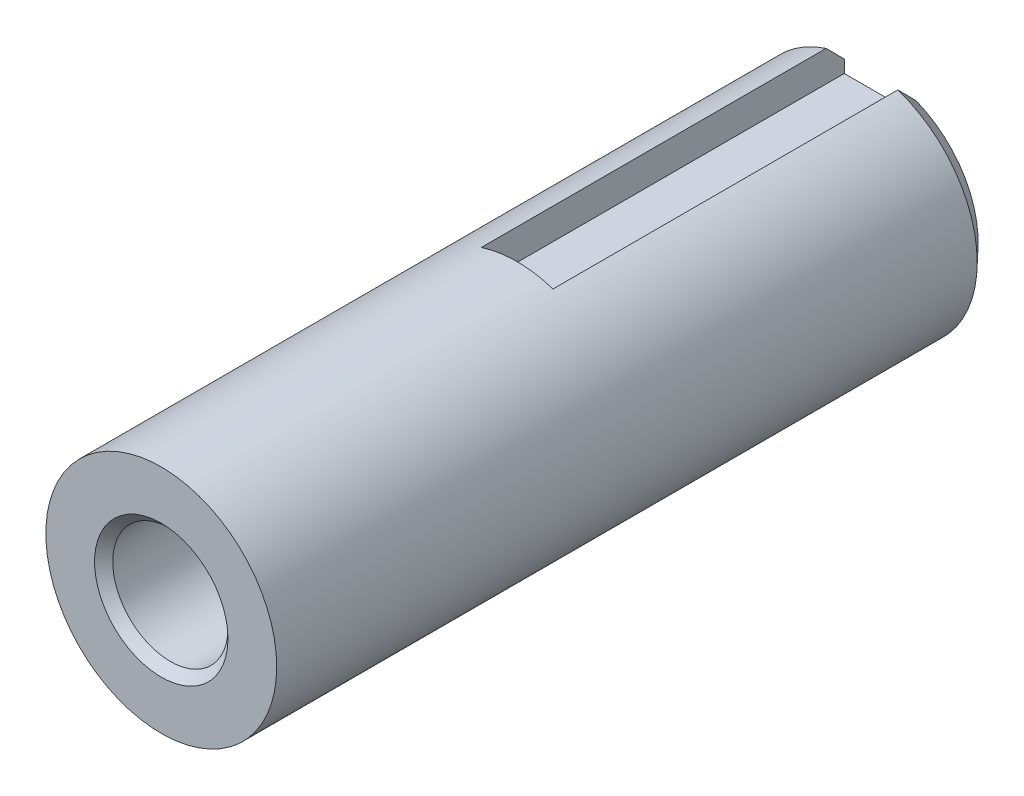
ISO-10303-21;
HEADER;
FILE_DESCRIPTION(('STEP AP214'),'2;1');
FILE_NAME('part.step','',(''),(''),'','','');
FILE_SCHEMA(('AUTOMOTIVE_DESIGN { 1 0 10303 214 1 1 1 1 }'));
ENDSEC;
DATA;
#1=APPLICATION_CONTEXT('core data for automotive mechanical design processes');
#2=APPLICATION_PROTOCOL_DEFINITION('international standard','automotive_design',2000,#1);
#3=PRODUCT_CONTEXT('',#1,'mechanical');
#4=PRODUCT('Part','Part','',(#3));
#5=PRODUCT_RELATED_PRODUCT_CATEGORY('part','',(#4));
#6=PRODUCT_DEFINITION_FORMATION('','',#4);
#7=PRODUCT_DEFINITION_CONTEXT('part definition',#1,'design');
#8=PRODUCT_DEFINITION('design','',#6,#7);
#9=PRODUCT_DEFINITION_SHAPE('','',#8);
#10=(LENGTH_UNIT() NAMED_UNIT(*) SI_UNIT(.MILLI.,.METRE.));
#11=(NAMED_UNIT(*) PLANE_ANGLE_UNIT() SI_UNIT($,.RADIAN.));
#12=(NAMED_UNIT(*) SI_UNIT($,.STERADIAN.) SOLID_ANGLE_UNIT());
#13=UNCERTAINTY_MEASURE_WITH_UNIT(LENGTH_MEASURE(1.E-05),#10,'distance_accuracy_value','');
#14=(GEOMETRIC_REPRESENTATION_CONTEXT(3) GLOBAL_UNCERTAINTY_ASSIGNED_CONTEXT((#13)) GLOBAL_UNIT_ASSIGNED_CONTEXT((#10,
#11,#12)) REPRESENTATION_CONTEXT('',''));
#15=CARTESIAN_POINT('',(0.,0.,0.));
#16=DIRECTION('',(0.,0.,1.));
#17=DIRECTION('',(1.,0.,0.));
#18=AXIS2_PLACEMENT_3D('',#15,#16,#17);
#19=CARTESIAN_POINT('',(0.,0.,-39.6));
#20=DIRECTION('',(0.,0.,1.));
#21=DIRECTION('',(1.,0.,0.));
#22=AXIS2_PLACEMENT_3D('',#19,#20,#21);
#23=CYLINDRICAL_SURFACE('',#22,6.36);
#24=DIRECTION('',(0.,0.,1.));
#25=VECTOR('',#24,1.);
#26=CARTESIAN_POINT('',(-1.96499999999999,6.048832531985,-39.6));
#27=LINE('',#26,#25);
#28=CARTESIAN_POINT('',(-1.96499999999999,6.048832531985,-38.6));
#29=VERTEX_POINT('',#28);
#30=CARTESIAN_POINT('',(-1.96499999999999,6.048832531985,-19.6));
#31=VERTEX_POINT('',#30);
#32=EDGE_CURVE('E113',#29,#31,#27,.T.);
#33=ORIENTED_EDGE('',*,*,#32,.F.);
#34=CARTESIAN_POINT('',(0.,0.,-38.6));
#35=DIRECTION('',(0.,0.,1.));
#36=DIRECTION('',(1.,0.,0.));
#37=AXIS2_PLACEMENT_3D('',#34,#35,#36);
#38=CIRCLE('',#37,6.36);
#39=CARTESIAN_POINT('',(1.985,6.04229881750315,-38.6));
#40=VERTEX_POINT('',#39);
#41=EDGE_CURVE('E123',#29,#40,#38,.T.);
#42=ORIENTED_EDGE('',*,*,#41,.T.);
#43=DIRECTION('',(0.,0.,1.));
#44=VECTOR('',#43,1.);
#45=CARTESIAN_POINT('',(1.985,6.04229881750315,-39.6));
#46=LINE('',#45,#44);
#47=CARTESIAN_POINT('',(1.985,6.04229881750315,-19.6));
#48=VERTEX_POINT('',#47);
#49=EDGE_CURVE('E110',#48,#40,#46,.F.);
#50=ORIENTED_EDGE('',*,*,#49,.F.);
#51=CARTESIAN_POINT('',(0.,0.,-19.6));
#52=DIRECTION('',(0.,0.,-1.));
#53=DIRECTION('',(-1.,0.,0.));
#54=AXIS2_PLACEMENT_3D('',#51,#52,#53);
#55=CIRCLE('',#54,6.36);
#56=EDGE_CURVE('E88',#48,#31,#55,.F.);
#57=ORIENTED_EDGE('',*,*,#56,.T.);
#58=EDGE_LOOP('',(#33,#42,#50,#57));
#59=FACE_BOUND('',#58,.T.);
#60=CARTESIAN_POINT('',(0.,0.,0.));
#61=DIRECTION('',(0.,0.,1.));
#62=DIRECTION('',(1.,0.,0.));
#63=AXIS2_PLACEMENT_3D('',#60,#61,#62);
#64=CIRCLE('',#63,6.36);
#65=CARTESIAN_POINT('',(6.36,0.,0.));
#66=VERTEX_POINT('',#65);
#67=EDGE_CURVE('E118',#66,#66,#64,.T.);
#68=ORIENTED_EDGE('',*,*,#67,.F.);
#69=EDGE_LOOP('',(#68));
#70=FACE_BOUND('',#69,.T.);
#71=ADVANCED_FACE('F33',(#59,#70),#23,.T.);
#72=CARTESIAN_POINT('',(0.,0.,-39.6));
#73=DIRECTION('',(0.,0.,1.));
#74=DIRECTION('',(1.,0.,0.));
#75=AXIS2_PLACEMENT_3D('',#72,#73,#74);
#76=PLANE('',#75);
#77=DIRECTION('',(0.,1.,0.));
#78=VECTOR('',#77,1.);
#79=CARTESIAN_POINT('',(1.985,0.,-39.6));
#80=LINE('',#79,#78);
#81=CARTESIAN_POINT('',(1.985,4.35,-39.6));
#82=VERTEX_POINT('',#81);
#83=CARTESIAN_POINT('',(1.985,5.032680697203,-39.6));
#84=VERTEX_POINT('',#83);
#85=EDGE_CURVE('E95',#82,#84,#80,.T.);
#86=ORIENTED_EDGE('',*,*,#85,.T.);
#87=CARTESIAN_POINT('',(0.,0.,-39.6));
#88=DIRECTION('',(0.,0.,1.));
#89=DIRECTION('',(1.,0.,0.));
#90=AXIS2_PLACEMENT_3D('',#87,#88,#89);
#91=CIRCLE('',#90,5.40999999999997);
#92=CARTESIAN_POINT('',(-1.96499999999999,5.0405232863265,-39.6));
#93=VERTEX_POINT('',#92);
#94=EDGE_CURVE('E48',#84,#93,#91,.F.);
#95=ORIENTED_EDGE('',*,*,#94,.T.);
#96=DIRECTION('',(0.,1.,0.));
#97=VECTOR('',#96,1.);
#98=CARTESIAN_POINT('',(-1.96499999999999,6.74396395755664,-39.6));
#99=LINE('',#98,#97);
#100=CARTESIAN_POINT('',(-1.96499999999999,4.35,-39.6));
#101=VERTEX_POINT('',#100);
#102=EDGE_CURVE('E106',#101,#93,#99,.T.);
#103=ORIENTED_EDGE('',*,*,#102,.F.);
#104=DIRECTION('',(-1.,0.,0.));
#105=VECTOR('',#104,1.);
#106=CARTESIAN_POINT('',(1.985,4.35,-39.6));
#107=LINE('',#106,#105);
#108=EDGE_CURVE('E108',#82,#101,#107,.T.);
#109=ORIENTED_EDGE('',*,*,#108,.F.);
#110=EDGE_LOOP('',(#86,#95,#103,#109));
#111=FACE_BOUND('',#110,.T.);
#112=ADVANCED_FACE('F165',(#111),#76,.F.);
#113=CARTESIAN_POINT('',(0.,0.,0.));
#114=DIRECTION('',(0.,0.,1.));
#115=DIRECTION('',(1.,0.,0.));
#116=AXIS2_PLACEMENT_3D('',#113,#114,#115);
#117=PLANE('',#116);
#118=CARTESIAN_POINT('',(0.,0.,0.));
#119=DIRECTION('',(0.,0.,1.));
#120=DIRECTION('',(1.,0.,0.));
#121=AXIS2_PLACEMENT_3D('',#118,#119,#120);
#122=CIRCLE('',#121,3.675);
#123=CARTESIAN_POINT('',(3.675,0.,0.));
#124=VERTEX_POINT('',#123);
#125=EDGE_CURVE('E11',#124,#124,#122,.F.);
#126=ORIENTED_EDGE('',*,*,#125,.T.);
#127=EDGE_LOOP('',(#126));
#128=FACE_BOUND('',#127,.T.);
#129=ORIENTED_EDGE('',*,*,#67,.T.);
#130=EDGE_LOOP('',(#129));
#131=FACE_BOUND('',#130,.T.);
#132=ADVANCED_FACE('F170',(#128,#131),#117,.T.);
#133=CARTESIAN_POINT('',(0.,0.,-19.3));
#134=DIRECTION('',(0.,0.,1.));
#135=DIRECTION('',(1.,0.,0.));
#136=AXIS2_PLACEMENT_3D('',#133,#134,#135);
#137=CYLINDRICAL_SURFACE('',#136,3.175);
#138=CARTESIAN_POINT('',(0.,0.,-0.500000000000004));
#139=DIRECTION('',(0.,0.,1.));
#140=DIRECTION('',(1.,0.,0.));
#141=AXIS2_PLACEMENT_3D('',#138,#139,#140);
#142=CIRCLE('',#141,3.175);
#143=CARTESIAN_POINT('',(3.175,0.,-0.500000000000004));
#144=VERTEX_POINT('',#143);
#145=EDGE_CURVE('E41',#144,#144,#142,.T.);
#146=ORIENTED_EDGE('',*,*,#145,.T.);
#147=EDGE_LOOP('',(#146));
#148=FACE_BOUND('',#147,.T.);
#149=CARTESIAN_POINT('',(0.,0.,-19.3));
#150=DIRECTION('',(0.,0.,1.));
#151=DIRECTION('',(1.,0.,0.));
#152=AXIS2_PLACEMENT_3D('',#149,#150,#151);
#153=CIRCLE('',#152,3.175);
#154=CARTESIAN_POINT('',(3.175,0.,-19.3));
#155=VERTEX_POINT('',#154);
#156=EDGE_CURVE('E115',#155,#155,#153,.T.);
#157=ORIENTED_EDGE('',*,*,#156,.F.);
#158=EDGE_LOOP('',(#157));
#159=FACE_BOUND('',#158,.T.);
#160=ADVANCED_FACE('F154',(#148,#159),#137,.F.);
#161=CARTESIAN_POINT('',(0.,0.,-19.3));
#162=DIRECTION('',(0.,0.,1.));
#163=DIRECTION('',(1.,0.,0.));
#164=AXIS2_PLACEMENT_3D('',#161,#162,#163);
#165=PLANE('',#164);
#166=ORIENTED_EDGE('',*,*,#156,.T.);
#167=EDGE_LOOP('',(#166));
#168=FACE_BOUND('',#167,.T.);
#169=ADVANCED_FACE('F144',(#168),#165,.T.);
#170=CARTESIAN_POINT('',(-1.96499999999999,6.74396395755664,-19.6));
#171=DIRECTION('',(-1.,0.,0.));
#172=DIRECTION('',(0.,0.,1.));
#173=AXIS2_PLACEMENT_3D('',#170,#171,#172);
#174=PLANE('',#173);
#175=ORIENTED_EDGE('',*,*,#102,.T.);
#176=CARTESIAN_POINT('',(-1.96499999999999,5.0405232863265,-39.6));
#177=CARTESIAN_POINT('',(-1.96499999999999,5.12501292637304,-39.517135468077));
#178=CARTESIAN_POINT('',(-1.96499999999999,5.2093670835575,-39.4341329970119));
#179=CARTESIAN_POINT('',(-1.96499999999999,5.37783412224406,-39.2678846308443));
#180=CARTESIAN_POINT('',(-1.96499999999999,5.46194700532039,-39.1846387373372));
#181=CARTESIAN_POINT('',(-1.96499999999999,5.62996216650275,-39.0179350185267));
#182=CARTESIAN_POINT('',(-1.96499999999999,5.71386444491842,-38.9344771935351));
#183=CARTESIAN_POINT('',(-1.96499999999999,5.88148257272598,-38.767373427852));
#184=CARTESIAN_POINT('',(-1.96499999999999,5.9651984208965,-38.6837274859353));
#185=CARTESIAN_POINT('',(-1.96499999999999,6.048832531985,-38.6));
#186=B_SPLINE_CURVE_WITH_KNOTS('',3,(#176,#177,#178,#179,#180,#181,#182,#183,#184,#185),
.UNSPECIFIED.,.F.,.F.,(4,2,2,2,4),(0.,0.355028187142083,0.710054052554152,1.06507939566196,
1.42010705783262),.UNSPECIFIED.);
#187=EDGE_CURVE('E147',#93,#29,#186,.T.);
#188=ORIENTED_EDGE('',*,*,#187,.T.);
#189=ORIENTED_EDGE('',*,*,#32,.T.);
#190=DIRECTION('',(0.,1.,0.));
#191=VECTOR('',#190,1.);
#192=CARTESIAN_POINT('',(-1.96499999999999,6.74396395755664,-19.6));
#193=LINE('',#192,#191);
#194=CARTESIAN_POINT('',(-1.96499999999999,4.35,-19.6));
#195=VERTEX_POINT('',#194);
#196=EDGE_CURVE('E90',#195,#31,#193,.T.);
#197=ORIENTED_EDGE('',*,*,#196,.F.);
#198=DIRECTION('',(0.,0.,-1.));
#199=VECTOR('',#198,1.);
#200=CARTESIAN_POINT('',(-1.96499999999999,4.35,-19.6));
#201=LINE('',#200,#199);
#202=EDGE_CURVE('E99',#195,#101,#201,.T.);
#203=ORIENTED_EDGE('',*,*,#202,.T.);
#204=EDGE_LOOP('',(#175,#188,#189,#197,#203));
#205=FACE_BOUND('',#204,.T.);
#206=ADVANCED_FACE('F140',(#205),#174,.F.);
#207=CARTESIAN_POINT('',(1.985,4.35,-19.6));
#208=DIRECTION('',(0.,-1.,0.));
#209=DIRECTION('',(0.,0.,-1.));
#210=AXIS2_PLACEMENT_3D('',#207,#208,#209);
#211=PLANE('',#210);
#212=ORIENTED_EDGE('',*,*,#108,.T.);
#213=ORIENTED_EDGE('',*,*,#202,.F.);
#214=DIRECTION('',(-1.,0.,0.));
#215=VECTOR('',#214,1.);
#216=CARTESIAN_POINT('',(1.985,4.35,-19.6));
#217=LINE('',#216,#215);
#218=CARTESIAN_POINT('',(1.985,4.35,-19.6));
#219=VERTEX_POINT('',#218);
#220=EDGE_CURVE('E86',#219,#195,#217,.T.);
#221=ORIENTED_EDGE('',*,*,#220,.F.);
#222=DIRECTION('',(0.,0.,-1.));
#223=VECTOR('',#222,1.);
#224=CARTESIAN_POINT('',(1.985,4.35,-19.6));
#225=LINE('',#224,#223);
#226=EDGE_CURVE('E93',#219,#82,#225,.T.);
#227=ORIENTED_EDGE('',*,*,#226,.T.);
#228=EDGE_LOOP('',(#212,#213,#221,#227));
#229=FACE_BOUND('',#228,.T.);
#230=ADVANCED_FACE('F101',(#229),#211,.F.);
#231=CARTESIAN_POINT('',(1.985,4.35,-19.6));
#232=DIRECTION('',(1.,0.,0.));
#233=DIRECTION('',(0.,0.,-1.));
#234=AXIS2_PLACEMENT_3D('',#231,#232,#233);
#235=PLANE('',#234);
#236=ORIENTED_EDGE('',*,*,#49,.T.);
#237=CARTESIAN_POINT('',(1.985,6.04229881750315,-38.6));
#238=CARTESIAN_POINT('',(1.985,5.95856465535904,-38.6837370708416));
#239=CARTESIAN_POINT('',(1.985,5.87474688585204,-38.7673906441105));
#240=CARTESIAN_POINT('',(1.985,5.70692064020319,-38.9345051053907));
#241=CARTESIAN_POINT('',(1.985,5.62291216536925,-39.0179659947157));
#242=CARTESIAN_POINT('',(1.985,5.45467974314621,-39.1846706722157));
#243=CARTESIAN_POINT('',(1.985,5.37045579542537,-39.2679144600561));
#244=CARTESIAN_POINT('',(1.985,5.20176101218862,-39.4341526227197));
#245=CARTESIAN_POINT('',(1.985,5.11729017498657,-39.5171469958316));
#246=CARTESIAN_POINT('',(1.985,5.032680697203,-39.6));
#247=B_SPLINE_CURVE_WITH_KNOTS('',3,(#237,#238,#239,#240,#241,#242,#243,#244,#245,#246),
.UNSPECIFIED.,.F.,.F.,(4,2,2,2,4),(0.,0.355260182291657,0.710517935451724,1.06577623590744,
1.42103696829736),.UNSPECIFIED.);
#248=EDGE_CURVE('E56',#40,#84,#247,.T.);
#249=ORIENTED_EDGE('',*,*,#248,.T.);
#250=ORIENTED_EDGE('',*,*,#85,.F.);
#251=ORIENTED_EDGE('',*,*,#226,.F.);
#252=DIRECTION('',(0.,-1.,0.));
#253=VECTOR('',#252,1.);
#254=CARTESIAN_POINT('',(1.985,4.35,-19.6));
#255=LINE('',#254,#253);
#256=EDGE_CURVE('E81',#48,#219,#255,.T.);
#257=ORIENTED_EDGE('',*,*,#256,.F.);
#258=EDGE_LOOP('',(#236,#249,#250,#251,#257));
#259=FACE_BOUND('',#258,.T.);
#260=ADVANCED_FACE('F94',(#259),#235,.F.);
#261=CARTESIAN_POINT('',(0.,0.,-19.6));
#262=DIRECTION('',(0.,0.,-1.));
#263=DIRECTION('',(-1.,0.,0.));
#264=AXIS2_PLACEMENT_3D('',#261,#262,#263);
#265=PLANE('',#264);
#266=ORIENTED_EDGE('',*,*,#256,.T.);
#267=ORIENTED_EDGE('',*,*,#220,.T.);
#268=ORIENTED_EDGE('',*,*,#196,.T.);
#269=ORIENTED_EDGE('',*,*,#56,.F.);
#270=EDGE_LOOP('',(#266,#267,#268,#269));
#271=FACE_BOUND('',#270,.T.);
#272=ADVANCED_FACE('F83',(#271),#265,.T.);
#273=CARTESIAN_POINT('',(0.,0.,-38.6));
#274=DIRECTION('',(0.,0.,1.));
#275=DIRECTION('',(1.,0.,0.));
#276=AXIS2_PLACEMENT_3D('',#273,#274,#275);
#277=CONICAL_SURFACE('',#276,6.36,0.759762754875767);
#278=ORIENTED_EDGE('',*,*,#187,.F.);
#279=ORIENTED_EDGE('',*,*,#94,.F.);
#280=ORIENTED_EDGE('',*,*,#248,.F.);
#281=ORIENTED_EDGE('',*,*,#41,.F.);
#282=EDGE_LOOP('',(#278,#279,#280,#281));
#283=FACE_BOUND('',#282,.T.);
#284=ADVANCED_FACE('F132',(#283),#277,.T.);
#285=CARTESIAN_POINT('',(0.,0.,-0.500000000000004));
#286=DIRECTION('',(0.,0.,1.));
#287=DIRECTION('',(1.,0.,0.));
#288=AXIS2_PLACEMENT_3D('',#285,#286,#287);
#289=CONICAL_SURFACE('',#288,3.175,0.785398163397447);
#290=ORIENTED_EDGE('',*,*,#125,.F.);
#291=EDGE_LOOP('',(#290));
#292=FACE_BOUND('',#291,.T.);
#293=ORIENTED_EDGE('',*,*,#145,.F.);
#294=EDGE_LOOP('',(#293));
#295=FACE_BOUND('',#294,.T.);
#296=ADVANCED_FACE('F35',(#292,#295),#289,.F.);
#297=CLOSED_SHELL('',(#71,#112,#132,#160,#169,#206,#230,#260,#272,#284,#296));
#298=MANIFOLD_SOLID_BREP('B2',#297);
#299=ADVANCED_BREP_SHAPE_REPRESENTATION('',(#18,#298),#14);
#300=SHAPE_DEFINITION_REPRESENTATION(#9,#299);
ENDSEC;
END-ISO-10303-21;
